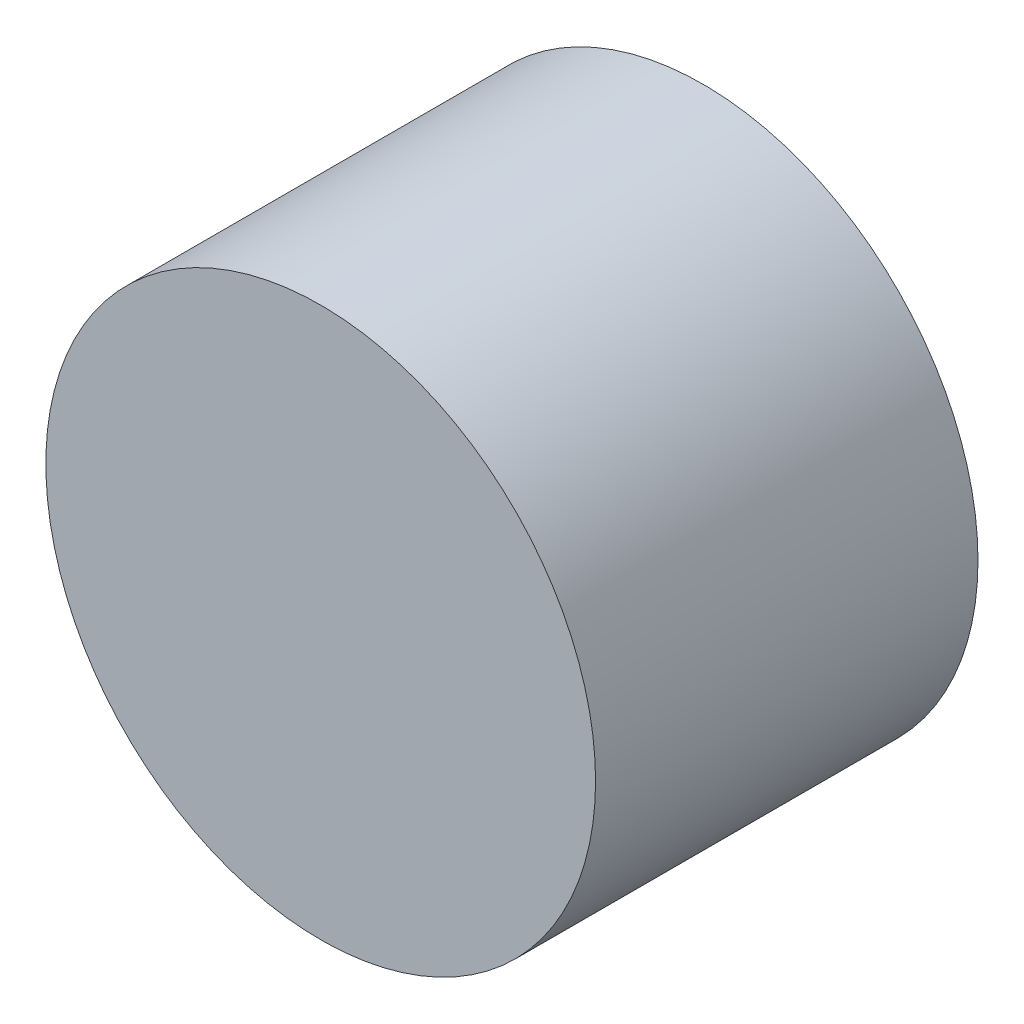
ISO-10303-21;
HEADER;
FILE_DESCRIPTION(('STEP AP214'),'2;1');
FILE_NAME('part.step','',(''),(''),'','','');
FILE_SCHEMA(('AUTOMOTIVE_DESIGN { 1 0 10303 214 1 1 1 1 }'));
ENDSEC;
DATA;
#1=APPLICATION_CONTEXT('core data for automotive mechanical design processes');
#2=APPLICATION_PROTOCOL_DEFINITION('international standard','automotive_design',2000,#1);
#3=PRODUCT_CONTEXT('',#1,'mechanical');
#4=PRODUCT('Part','Part','',(#3));
#5=PRODUCT_RELATED_PRODUCT_CATEGORY('part','',(#4));
#6=PRODUCT_DEFINITION_FORMATION('','',#4);
#7=PRODUCT_DEFINITION_CONTEXT('part definition',#1,'design');
#8=PRODUCT_DEFINITION('design','',#6,#7);
#9=PRODUCT_DEFINITION_SHAPE('','',#8);
#10=(LENGTH_UNIT() NAMED_UNIT(*) SI_UNIT(.MILLI.,.METRE.));
#11=(NAMED_UNIT(*) PLANE_ANGLE_UNIT() SI_UNIT($,.RADIAN.));
#12=(NAMED_UNIT(*) SI_UNIT($,.STERADIAN.) SOLID_ANGLE_UNIT());
#13=UNCERTAINTY_MEASURE_WITH_UNIT(LENGTH_MEASURE(1.E-05),#10,'distance_accuracy_value','');
#14=(GEOMETRIC_REPRESENTATION_CONTEXT(3) GLOBAL_UNCERTAINTY_ASSIGNED_CONTEXT((#13)) GLOBAL_UNIT_ASSIGNED_CONTEXT((#10,
#11,#12)) REPRESENTATION_CONTEXT('',''));
#15=CARTESIAN_POINT('',(0.,0.,0.));
#16=DIRECTION('',(0.,0.,1.));
#17=DIRECTION('',(1.,0.,0.));
#18=AXIS2_PLACEMENT_3D('',#15,#16,#17);
#19=CARTESIAN_POINT('',(0.,0.,25.4));
#20=DIRECTION('',(0.,0.,-1.));
#21=DIRECTION('',(-1.,0.,0.));
#22=AXIS2_PLACEMENT_3D('',#19,#20,#21);
#23=CYLINDRICAL_SURFACE('',#22,18.25625);
#24=CARTESIAN_POINT('',(0.,0.,25.4));
#25=DIRECTION('',(0.,0.,1.));
#26=DIRECTION('',(1.,0.,0.));
#27=AXIS2_PLACEMENT_3D('',#24,#25,#26);
#28=CIRCLE('',#27,18.25625);
#29=CARTESIAN_POINT('',(18.25625,0.,25.4));
#30=VERTEX_POINT('',#29);
#31=EDGE_CURVE('E12',#30,#30,#28,.T.);
#32=ORIENTED_EDGE('',*,*,#31,.F.);
#33=EDGE_LOOP('',(#32));
#34=FACE_BOUND('',#33,.T.);
#35=CARTESIAN_POINT('',(0.,0.,0.));
#36=DIRECTION('',(0.,0.,1.));
#37=DIRECTION('',(1.,0.,0.));
#38=AXIS2_PLACEMENT_3D('',#35,#36,#37);
#39=CIRCLE('',#38,18.25625);
#40=CARTESIAN_POINT('',(18.25625,0.,0.));
#41=VERTEX_POINT('',#40);
#42=EDGE_CURVE('E46',#41,#41,#39,.T.);
#43=ORIENTED_EDGE('',*,*,#42,.T.);
#44=EDGE_LOOP('',(#43));
#45=FACE_BOUND('',#44,.T.);
#46=ADVANCED_FACE('F43',(#34,#45),#23,.T.);
#47=CARTESIAN_POINT('',(0.,0.,25.4));
#48=DIRECTION('',(0.,0.,1.));
#49=DIRECTION('',(1.,0.,0.));
#50=AXIS2_PLACEMENT_3D('',#47,#48,#49);
#51=PLANE('',#50);
#52=ORIENTED_EDGE('',*,*,#31,.T.);
#53=EDGE_LOOP('',(#52));
#54=FACE_BOUND('',#53,.T.);
#55=ADVANCED_FACE('F58',(#54),#51,.T.);
#56=CARTESIAN_POINT('',(0.,0.,0.));
#57=DIRECTION('',(0.,0.,1.));
#58=DIRECTION('',(1.,0.,0.));
#59=AXIS2_PLACEMENT_3D('',#56,#57,#58);
#60=PLANE('',#59);
#61=ORIENTED_EDGE('',*,*,#42,.F.);
#62=EDGE_LOOP('',(#61));
#63=FACE_BOUND('',#62,.T.);
#64=ADVANCED_FACE('F56',(#63),#60,.F.);
#65=CLOSED_SHELL('',(#46,#55,#64));
#66=MANIFOLD_SOLID_BREP('B2',#65);
#67=ADVANCED_BREP_SHAPE_REPRESENTATION('',(#18,#66),#14);
#68=SHAPE_DEFINITION_REPRESENTATION(#9,#67);
ENDSEC;
END-ISO-10303-21;
